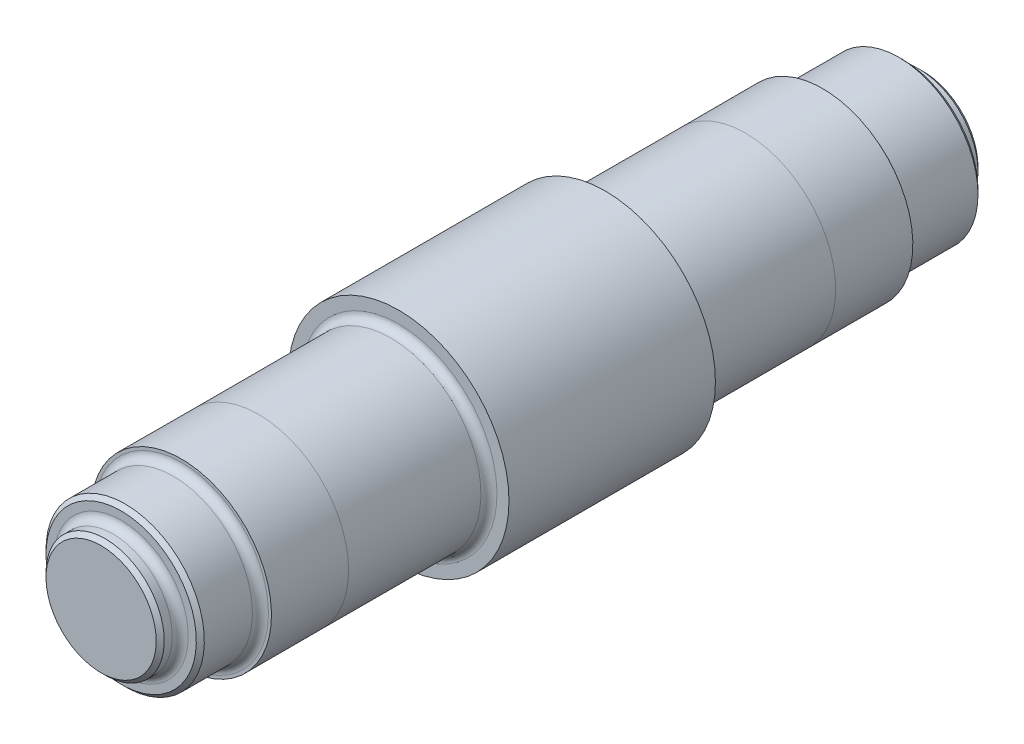
ISO-10303-21;
HEADER;
FILE_DESCRIPTION(('STEP AP214'),'2;1');
FILE_NAME('part.step','',(''),(''),'','','');
FILE_SCHEMA(('AUTOMOTIVE_DESIGN { 1 0 10303 214 1 1 1 1 }'));
ENDSEC;
DATA;
#1=APPLICATION_CONTEXT('core data for automotive mechanical design processes');
#2=APPLICATION_PROTOCOL_DEFINITION('international standard','automotive_design',2000,#1);
#3=PRODUCT_CONTEXT('',#1,'mechanical');
#4=PRODUCT('Part','Part','',(#3));
#5=PRODUCT_RELATED_PRODUCT_CATEGORY('part','',(#4));
#6=PRODUCT_DEFINITION_FORMATION('','',#4);
#7=PRODUCT_DEFINITION_CONTEXT('part definition',#1,'design');
#8=PRODUCT_DEFINITION('design','',#6,#7);
#9=PRODUCT_DEFINITION_SHAPE('','',#8);
#10=(LENGTH_UNIT() NAMED_UNIT(*) SI_UNIT(.MILLI.,.METRE.));
#11=(NAMED_UNIT(*) PLANE_ANGLE_UNIT() SI_UNIT($,.RADIAN.));
#12=(NAMED_UNIT(*) SI_UNIT($,.STERADIAN.) SOLID_ANGLE_UNIT());
#13=UNCERTAINTY_MEASURE_WITH_UNIT(LENGTH_MEASURE(1.E-05),#10,'distance_accuracy_value','');
#14=(GEOMETRIC_REPRESENTATION_CONTEXT(3) GLOBAL_UNCERTAINTY_ASSIGNED_CONTEXT((#13)) GLOBAL_UNIT_ASSIGNED_CONTEXT((#10,
#11,#12)) REPRESENTATION_CONTEXT('',''));
#15=CARTESIAN_POINT('',(0.,0.,0.));
#16=DIRECTION('',(0.,0.,1.));
#17=DIRECTION('',(1.,0.,0.));
#18=AXIS2_PLACEMENT_3D('',#15,#16,#17);
#19=CARTESIAN_POINT('',(0.,0.,20.));
#20=DIRECTION('',(0.,0.,1.));
#21=DIRECTION('',(0.,-1.,0.));
#22=AXIS2_PLACEMENT_3D('',#19,#20,#21);
#23=CYLINDRICAL_SURFACE('',#22,4.5);
#24=CARTESIAN_POINT('',(0.,0.,5.55));
#25=DIRECTION('',(0.,0.,-1.));
#26=DIRECTION('',(0.,1.,0.));
#27=AXIS2_PLACEMENT_3D('',#24,#25,#26);
#28=CIRCLE('',#27,4.5);
#29=CARTESIAN_POINT('',(0.,4.5,5.55));
#30=VERTEX_POINT('',#29);
#31=EDGE_CURVE('E134',#30,#30,#28,.F.);
#32=ORIENTED_EDGE('',*,*,#31,.T.);
#33=EDGE_LOOP('',(#32));
#34=FACE_BOUND('',#33,.T.);
#35=CARTESIAN_POINT('',(0.,0.,12.15));
#36=DIRECTION('',(0.,0.,1.));
#37=DIRECTION('',(1.,0.,0.));
#38=AXIS2_PLACEMENT_3D('',#35,#36,#37);
#39=CIRCLE('',#38,4.5);
#40=CARTESIAN_POINT('',(0.,4.5,12.15));
#41=VERTEX_POINT('',#40);
#42=CARTESIAN_POINT('',(0.,-4.5,12.15));
#43=VERTEX_POINT('',#42);
#44=EDGE_CURVE('E12',#41,#43,#39,.T.);
#45=ORIENTED_EDGE('',*,*,#44,.F.);
#46=EDGE_CURVE('E45',#43,#41,#39,.T.);
#47=ORIENTED_EDGE('',*,*,#46,.F.);
#48=EDGE_LOOP('',(#45,#47));
#49=FACE_BOUND('',#48,.T.);
#50=ADVANCED_FACE('F40',(#34,#49),#23,.T.);
#51=CARTESIAN_POINT('',(0.,0.,20.));
#52=DIRECTION('',(0.,0.,1.));
#53=DIRECTION('',(0.,-1.,0.));
#54=AXIS2_PLACEMENT_3D('',#51,#52,#53);
#55=CYLINDRICAL_SURFACE('',#54,4.5);
#56=CARTESIAN_POINT('',(0.,0.,-5.55));
#57=DIRECTION('',(0.,0.,1.));
#58=DIRECTION('',(0.,-1.,0.));
#59=AXIS2_PLACEMENT_3D('',#56,#57,#58);
#60=CIRCLE('',#59,4.5);
#61=CARTESIAN_POINT('',(0.,-4.5,-5.55));
#62=VERTEX_POINT('',#61);
#63=EDGE_CURVE('E125',#62,#62,#60,.F.);
#64=ORIENTED_EDGE('',*,*,#63,.T.);
#65=EDGE_LOOP('',(#64));
#66=FACE_BOUND('',#65,.T.);
#67=CARTESIAN_POINT('',(0.,0.,-12.15));
#68=DIRECTION('',(0.,0.,-1.));
#69=DIRECTION('',(-1.,0.,0.));
#70=AXIS2_PLACEMENT_3D('',#67,#68,#69);
#71=CIRCLE('',#70,4.5);
#72=CARTESIAN_POINT('',(0.,4.5,-12.15));
#73=VERTEX_POINT('',#72);
#74=CARTESIAN_POINT('',(0.,-4.5,-12.15));
#75=VERTEX_POINT('',#74);
#76=EDGE_CURVE('E65',#73,#75,#71,.T.);
#77=ORIENTED_EDGE('',*,*,#76,.F.);
#78=EDGE_CURVE('E69',#75,#73,#71,.T.);
#79=ORIENTED_EDGE('',*,*,#78,.F.);
#80=EDGE_LOOP('',(#77,#79));
#81=FACE_BOUND('',#80,.T.);
#82=ADVANCED_FACE('F72',(#66,#81),#55,.T.);
#83=CARTESIAN_POINT('',(0.,0.,20.));
#84=DIRECTION('',(0.,0.,1.));
#85=DIRECTION('',(0.,-1.,0.));
#86=AXIS2_PLACEMENT_3D('',#83,#84,#85);
#87=CYLINDRICAL_SURFACE('',#86,3.95);
#88=CARTESIAN_POINT('',(0.,0.,-19.8));
#89=DIRECTION('',(0.,0.,-1.));
#90=DIRECTION('',(0.,1.,0.));
#91=AXIS2_PLACEMENT_3D('',#88,#89,#90);
#92=CIRCLE('',#91,3.95);
#93=CARTESIAN_POINT('',(0.,3.95,-19.8));
#94=VERTEX_POINT('',#93);
#95=EDGE_CURVE('E83',#94,#94,#92,.F.);
#96=ORIENTED_EDGE('',*,*,#95,.T.);
#97=EDGE_LOOP('',(#96));
#98=FACE_BOUND('',#97,.T.);
#99=CARTESIAN_POINT('',(0.,0.,-16.4));
#100=DIRECTION('',(0.,0.,1.));
#101=DIRECTION('',(0.,-1.,0.));
#102=AXIS2_PLACEMENT_3D('',#99,#100,#101);
#103=CIRCLE('',#102,3.95);
#104=CARTESIAN_POINT('',(0.,-3.95000000000001,-16.4));
#105=VERTEX_POINT('',#104);
#106=EDGE_CURVE('E113',#105,#105,#103,.F.);
#107=ORIENTED_EDGE('',*,*,#106,.T.);
#108=EDGE_LOOP('',(#107));
#109=FACE_BOUND('',#108,.T.);
#110=ADVANCED_FACE('F175',(#98,#109),#87,.T.);
#111=ORIENTED_EDGE('',*,*,#78,.T.);
#112=ORIENTED_EDGE('',*,*,#76,.T.);
#113=EDGE_LOOP('',(#111,#112));
#114=FACE_BOUND('',#113,.T.);
#115=CARTESIAN_POINT('',(0.,0.,-16.));
#116=DIRECTION('',(0.,0.,1.));
#117=DIRECTION('',(0.,-1.,0.));
#118=AXIS2_PLACEMENT_3D('',#115,#116,#117);
#119=CIRCLE('',#118,4.5);
#120=CARTESIAN_POINT('',(0.,-4.5,-16.));
#121=VERTEX_POINT('',#120);
#122=EDGE_CURVE('E137',#121,#121,#119,.T.);
#123=ORIENTED_EDGE('',*,*,#122,.T.);
#124=EDGE_LOOP('',(#123));
#125=FACE_BOUND('',#124,.T.);
#126=ADVANCED_FACE('F67',(#114,#125),#55,.T.);
#127=CARTESIAN_POINT('',(0.,4.5,-16.));
#128=DIRECTION('',(0.,0.,1.));
#129=DIRECTION('',(0.,-1.,0.));
#130=AXIS2_PLACEMENT_3D('',#127,#128,#129);
#131=PLANE('',#130);
#132=CARTESIAN_POINT('',(0.,0.,-16.));
#133=DIRECTION('',(0.,0.,1.));
#134=DIRECTION('',(0.,-1.,0.));
#135=AXIS2_PLACEMENT_3D('',#132,#133,#134);
#136=CIRCLE('',#135,4.35);
#137=CARTESIAN_POINT('',(0.,-4.35000000000001,-16.));
#138=VERTEX_POINT('',#137);
#139=EDGE_CURVE('E116',#138,#138,#136,.T.);
#140=ORIENTED_EDGE('',*,*,#139,.T.);
#141=EDGE_LOOP('',(#140));
#142=FACE_BOUND('',#141,.T.);
#143=ORIENTED_EDGE('',*,*,#122,.F.);
#144=EDGE_LOOP('',(#143));
#145=FACE_BOUND('',#144,.T.);
#146=ADVANCED_FACE('F202',(#142,#145),#131,.F.);
#147=CARTESIAN_POINT('',(0.,0.,20.));
#148=DIRECTION('',(0.,0.,1.));
#149=DIRECTION('',(0.,-1.,0.));
#150=AXIS2_PLACEMENT_3D('',#147,#148,#149);
#151=CYLINDRICAL_SURFACE('',#150,3.94999999999999);
#152=CARTESIAN_POINT('',(0.,0.,18.8));
#153=DIRECTION('',(0.,0.,-1.));
#154=DIRECTION('',(0.,1.,0.));
#155=AXIS2_PLACEMENT_3D('',#152,#153,#154);
#156=CIRCLE('',#155,3.94999999999999);
#157=CARTESIAN_POINT('',(0.,3.94999999999999,18.8));
#158=VERTEX_POINT('',#157);
#159=EDGE_CURVE('E92',#158,#158,#156,.T.);
#160=ORIENTED_EDGE('',*,*,#159,.T.);
#161=EDGE_LOOP('',(#160));
#162=FACE_BOUND('',#161,.T.);
#163=CARTESIAN_POINT('',(0.,0.,16.4));
#164=DIRECTION('',(0.,0.,-1.));
#165=DIRECTION('',(0.,1.,0.));
#166=AXIS2_PLACEMENT_3D('',#163,#164,#165);
#167=CIRCLE('',#166,3.94999999999999);
#168=CARTESIAN_POINT('',(0.,3.94999999999999,16.4));
#169=VERTEX_POINT('',#168);
#170=EDGE_CURVE('E122',#169,#169,#167,.F.);
#171=ORIENTED_EDGE('',*,*,#170,.T.);
#172=EDGE_LOOP('',(#171));
#173=FACE_BOUND('',#172,.T.);
#174=ADVANCED_FACE('F187',(#162,#173),#151,.T.);
#175=CARTESIAN_POINT('',(0.,4.5,16.));
#176=DIRECTION('',(0.,0.,-1.));
#177=DIRECTION('',(0.,1.,0.));
#178=AXIS2_PLACEMENT_3D('',#175,#176,#177);
#179=PLANE('',#178);
#180=CARTESIAN_POINT('',(0.,0.,16.));
#181=DIRECTION('',(0.,0.,-1.));
#182=DIRECTION('',(0.,1.,0.));
#183=AXIS2_PLACEMENT_3D('',#180,#181,#182);
#184=CIRCLE('',#183,4.34999999999999);
#185=CARTESIAN_POINT('',(0.,4.34999999999999,16.));
#186=VERTEX_POINT('',#185);
#187=EDGE_CURVE('E119',#186,#186,#184,.T.);
#188=ORIENTED_EDGE('',*,*,#187,.T.);
#189=EDGE_LOOP('',(#188));
#190=FACE_BOUND('',#189,.T.);
#191=CARTESIAN_POINT('',(0.,0.,16.));
#192=DIRECTION('',(0.,0.,1.));
#193=DIRECTION('',(0.,-1.,0.));
#194=AXIS2_PLACEMENT_3D('',#191,#192,#193);
#195=CIRCLE('',#194,4.5);
#196=CARTESIAN_POINT('',(0.,-4.5,16.));
#197=VERTEX_POINT('',#196);
#198=EDGE_CURVE('E140',#197,#197,#195,.T.);
#199=ORIENTED_EDGE('',*,*,#198,.T.);
#200=EDGE_LOOP('',(#199));
#201=FACE_BOUND('',#200,.T.);
#202=ADVANCED_FACE('F181',(#190,#201),#179,.F.);
#203=ORIENTED_EDGE('',*,*,#46,.T.);
#204=ORIENTED_EDGE('',*,*,#44,.T.);
#205=EDGE_LOOP('',(#203,#204));
#206=FACE_BOUND('',#205,.T.);
#207=ORIENTED_EDGE('',*,*,#198,.F.);
#208=EDGE_LOOP('',(#207));
#209=FACE_BOUND('',#208,.T.);
#210=ADVANCED_FACE('F171',(#206,#209),#23,.T.);
#211=CARTESIAN_POINT('',(0.,5.5,5.15));
#212=DIRECTION('',(0.,0.,-1.));
#213=DIRECTION('',(0.,1.,0.));
#214=AXIS2_PLACEMENT_3D('',#211,#212,#213);
#215=PLANE('',#214);
#216=CARTESIAN_POINT('',(0.,0.,5.15));
#217=DIRECTION('',(0.,0.,-1.));
#218=DIRECTION('',(0.,1.,0.));
#219=AXIS2_PLACEMENT_3D('',#216,#217,#218);
#220=CIRCLE('',#219,4.9);
#221=CARTESIAN_POINT('',(0.,4.9,5.15));
#222=VERTEX_POINT('',#221);
#223=EDGE_CURVE('E131',#222,#222,#220,.T.);
#224=ORIENTED_EDGE('',*,*,#223,.T.);
#225=EDGE_LOOP('',(#224));
#226=FACE_BOUND('',#225,.T.);
#227=CARTESIAN_POINT('',(0.,0.,5.15));
#228=DIRECTION('',(0.,0.,1.));
#229=DIRECTION('',(0.,-1.,0.));
#230=AXIS2_PLACEMENT_3D('',#227,#228,#229);
#231=CIRCLE('',#230,5.5);
#232=CARTESIAN_POINT('',(0.,-5.5,5.15));
#233=VERTEX_POINT('',#232);
#234=EDGE_CURVE('E143',#233,#233,#231,.T.);
#235=ORIENTED_EDGE('',*,*,#234,.T.);
#236=EDGE_LOOP('',(#235));
#237=FACE_BOUND('',#236,.T.);
#238=ADVANCED_FACE('F164',(#226,#237),#215,.F.);
#239=CARTESIAN_POINT('',(0.,0.,20.));
#240=DIRECTION('',(0.,0.,1.));
#241=DIRECTION('',(0.,-1.,0.));
#242=AXIS2_PLACEMENT_3D('',#239,#240,#241);
#243=CYLINDRICAL_SURFACE('',#242,5.5);
#244=ORIENTED_EDGE('',*,*,#234,.F.);
#245=EDGE_LOOP('',(#244));
#246=FACE_BOUND('',#245,.T.);
#247=CARTESIAN_POINT('',(0.,0.,-5.15));
#248=DIRECTION('',(0.,0.,1.));
#249=DIRECTION('',(0.,-1.,0.));
#250=AXIS2_PLACEMENT_3D('',#247,#248,#249);
#251=CIRCLE('',#250,5.5);
#252=CARTESIAN_POINT('',(0.,-5.50000000000001,-5.15));
#253=VERTEX_POINT('',#252);
#254=EDGE_CURVE('E146',#253,#253,#251,.T.);
#255=ORIENTED_EDGE('',*,*,#254,.T.);
#256=EDGE_LOOP('',(#255));
#257=FACE_BOUND('',#256,.T.);
#258=ADVANCED_FACE('F150',(#246,#257),#243,.T.);
#259=CARTESIAN_POINT('',(0.,5.5,-5.15));
#260=DIRECTION('',(0.,0.,1.));
#261=DIRECTION('',(0.,-1.,0.));
#262=AXIS2_PLACEMENT_3D('',#259,#260,#261);
#263=PLANE('',#262);
#264=CARTESIAN_POINT('',(0.,0.,-5.15));
#265=DIRECTION('',(0.,0.,1.));
#266=DIRECTION('',(0.,-1.,0.));
#267=AXIS2_PLACEMENT_3D('',#264,#265,#266);
#268=CIRCLE('',#267,4.9);
#269=CARTESIAN_POINT('',(0.,-4.9,-5.15));
#270=VERTEX_POINT('',#269);
#271=EDGE_CURVE('E128',#270,#270,#268,.T.);
#272=ORIENTED_EDGE('',*,*,#271,.T.);
#273=EDGE_LOOP('',(#272));
#274=FACE_BOUND('',#273,.T.);
#275=ORIENTED_EDGE('',*,*,#254,.F.);
#276=EDGE_LOOP('',(#275));
#277=FACE_BOUND('',#276,.T.);
#278=ADVANCED_FACE('F152',(#274,#277),#263,.F.);
#279=CARTESIAN_POINT('',(0.,0.,5.55));
#280=DIRECTION('',(0.,0.,-1.));
#281=DIRECTION('',(0.,1.,0.));
#282=AXIS2_PLACEMENT_3D('',#279,#280,#281);
#283=TOROIDAL_SURFACE('',#282,4.9,0.4);
#284=ORIENTED_EDGE('',*,*,#223,.F.);
#285=EDGE_LOOP('',(#284));
#286=FACE_BOUND('',#285,.T.);
#287=ORIENTED_EDGE('',*,*,#31,.F.);
#288=EDGE_LOOP('',(#287));
#289=FACE_BOUND('',#288,.T.);
#290=ADVANCED_FACE('F154',(#286,#289),#283,.F.);
#291=CARTESIAN_POINT('',(0.,0.,-5.55));
#292=DIRECTION('',(0.,0.,1.));
#293=DIRECTION('',(0.,-1.,0.));
#294=AXIS2_PLACEMENT_3D('',#291,#292,#293);
#295=TOROIDAL_SURFACE('',#294,4.9,0.4);
#296=ORIENTED_EDGE('',*,*,#63,.F.);
#297=EDGE_LOOP('',(#296));
#298=FACE_BOUND('',#297,.T.);
#299=ORIENTED_EDGE('',*,*,#271,.F.);
#300=EDGE_LOOP('',(#299));
#301=FACE_BOUND('',#300,.T.);
#302=ADVANCED_FACE('F161',(#298,#301),#295,.F.);
#303=CARTESIAN_POINT('',(0.,0.,16.4));
#304=DIRECTION('',(0.,0.,-1.));
#305=DIRECTION('',(0.,1.,0.));
#306=AXIS2_PLACEMENT_3D('',#303,#304,#305);
#307=TOROIDAL_SURFACE('',#306,4.34999999999999,0.4);
#308=ORIENTED_EDGE('',*,*,#187,.F.);
#309=EDGE_LOOP('',(#308));
#310=FACE_BOUND('',#309,.T.);
#311=ORIENTED_EDGE('',*,*,#170,.F.);
#312=EDGE_LOOP('',(#311));
#313=FACE_BOUND('',#312,.T.);
#314=ADVANCED_FACE('F227',(#310,#313),#307,.F.);
#315=CARTESIAN_POINT('',(0.,0.,-16.4));
#316=DIRECTION('',(0.,0.,1.));
#317=DIRECTION('',(0.,-1.,0.));
#318=AXIS2_PLACEMENT_3D('',#315,#316,#317);
#319=TOROIDAL_SURFACE('',#318,4.35,0.4);
#320=ORIENTED_EDGE('',*,*,#106,.F.);
#321=EDGE_LOOP('',(#320));
#322=FACE_BOUND('',#321,.T.);
#323=ORIENTED_EDGE('',*,*,#139,.F.);
#324=EDGE_LOOP('',(#323));
#325=FACE_BOUND('',#324,.T.);
#326=ADVANCED_FACE('F231',(#322,#325),#319,.F.);
#327=CARTESIAN_POINT('',(0.,0.,19.));
#328=DIRECTION('',(0.,0.,-1.));
#329=DIRECTION('',(0.,1.,0.));
#330=AXIS2_PLACEMENT_3D('',#327,#328,#329);
#331=PLANE('',#330);
#332=CARTESIAN_POINT('',(0.,0.,19.));
#333=DIRECTION('',(0.,0.,-1.));
#334=DIRECTION('',(0.,1.,0.));
#335=AXIS2_PLACEMENT_3D('',#332,#333,#334);
#336=CIRCLE('',#335,3.74999999999999);
#337=CARTESIAN_POINT('',(0.,3.74999999999999,19.));
#338=VERTEX_POINT('',#337);
#339=EDGE_CURVE('E89',#338,#338,#336,.F.);
#340=ORIENTED_EDGE('',*,*,#339,.T.);
#341=EDGE_LOOP('',(#340));
#342=FACE_BOUND('',#341,.T.);
#343=CARTESIAN_POINT('',(0.,0.,19.));
#344=DIRECTION('',(0.,0.,-1.));
#345=DIRECTION('',(0.,1.,0.));
#346=AXIS2_PLACEMENT_3D('',#343,#344,#345);
#347=CIRCLE('',#346,3.35);
#348=CARTESIAN_POINT('',(0.,3.35,19.));
#349=VERTEX_POINT('',#348);
#350=EDGE_CURVE('E104',#349,#349,#347,.T.);
#351=ORIENTED_EDGE('',*,*,#350,.T.);
#352=EDGE_LOOP('',(#351));
#353=FACE_BOUND('',#352,.T.);
#354=ADVANCED_FACE('F235',(#342,#353),#331,.F.);
#355=CARTESIAN_POINT('',(0.,0.,19.));
#356=DIRECTION('',(0.,0.,1.));
#357=DIRECTION('',(1.,0.,0.));
#358=AXIS2_PLACEMENT_3D('',#355,#356,#357);
#359=CYLINDRICAL_SURFACE('',#358,2.95);
#360=CARTESIAN_POINT('',(0.,0.,19.8));
#361=DIRECTION('',(0.,0.,-1.));
#362=DIRECTION('',(-1.,0.,0.));
#363=AXIS2_PLACEMENT_3D('',#360,#361,#362);
#364=CIRCLE('',#363,2.95);
#365=CARTESIAN_POINT('',(-2.95,0.,19.8));
#366=VERTEX_POINT('',#365);
#367=EDGE_CURVE('E98',#366,#366,#364,.T.);
#368=ORIENTED_EDGE('',*,*,#367,.T.);
#369=EDGE_LOOP('',(#368));
#370=FACE_BOUND('',#369,.T.);
#371=CARTESIAN_POINT('',(0.,0.,19.4));
#372=DIRECTION('',(0.,0.,-1.));
#373=DIRECTION('',(0.,1.,0.));
#374=AXIS2_PLACEMENT_3D('',#371,#372,#373);
#375=CIRCLE('',#374,2.95);
#376=CARTESIAN_POINT('',(0.,2.95,19.4));
#377=VERTEX_POINT('',#376);
#378=EDGE_CURVE('E101',#377,#377,#375,.F.);
#379=ORIENTED_EDGE('',*,*,#378,.T.);
#380=EDGE_LOOP('',(#379));
#381=FACE_BOUND('',#380,.T.);
#382=ADVANCED_FACE('F210',(#370,#381),#359,.T.);
#383=CARTESIAN_POINT('',(0.,3.94999999999999,20.));
#384=DIRECTION('',(0.,0.,-1.));
#385=DIRECTION('',(0.,1.,0.));
#386=AXIS2_PLACEMENT_3D('',#383,#384,#385);
#387=PLANE('',#386);
#388=CARTESIAN_POINT('',(0.,0.,20.));
#389=DIRECTION('',(0.,0.,-1.));
#390=DIRECTION('',(0.,1.,0.));
#391=AXIS2_PLACEMENT_3D('',#388,#389,#390);
#392=CIRCLE('',#391,2.75);
#393=CARTESIAN_POINT('',(0.,2.75,20.));
#394=VERTEX_POINT('',#393);
#395=EDGE_CURVE('E95',#394,#394,#392,.F.);
#396=ORIENTED_EDGE('',*,*,#395,.T.);
#397=EDGE_LOOP('',(#396));
#398=FACE_BOUND('',#397,.T.);
#399=ADVANCED_FACE('F206',(#398),#387,.F.);
#400=CARTESIAN_POINT('',(0.,0.,-20.));
#401=DIRECTION('',(0.,0.,-1.));
#402=DIRECTION('',(0.,1.,0.));
#403=AXIS2_PLACEMENT_3D('',#400,#401,#402);
#404=PLANE('',#403);
#405=CARTESIAN_POINT('',(0.,0.,-20.));
#406=DIRECTION('',(0.,0.,-1.));
#407=DIRECTION('',(0.,1.,0.));
#408=AXIS2_PLACEMENT_3D('',#405,#406,#407);
#409=CIRCLE('',#408,3.75000000000002);
#410=CARTESIAN_POINT('',(0.,3.75000000000001,-20.));
#411=VERTEX_POINT('',#410);
#412=EDGE_CURVE('E86',#411,#411,#409,.T.);
#413=ORIENTED_EDGE('',*,*,#412,.T.);
#414=EDGE_LOOP('',(#413));
#415=FACE_BOUND('',#414,.T.);
#416=CARTESIAN_POINT('',(0.,0.,-20.));
#417=DIRECTION('',(0.,0.,-1.));
#418=DIRECTION('',(0.,1.,0.));
#419=AXIS2_PLACEMENT_3D('',#416,#417,#418);
#420=CIRCLE('',#419,3.35);
#421=CARTESIAN_POINT('',(0.,3.35,-20.));
#422=VERTEX_POINT('',#421);
#423=EDGE_CURVE('E110',#422,#422,#420,.F.);
#424=ORIENTED_EDGE('',*,*,#423,.T.);
#425=EDGE_LOOP('',(#424));
#426=FACE_BOUND('',#425,.T.);
#427=ADVANCED_FACE('F209',(#415,#426),#404,.T.);
#428=CARTESIAN_POINT('',(0.,0.,-20.));
#429=DIRECTION('',(0.,0.,-1.));
#430=DIRECTION('',(-1.,0.,0.));
#431=AXIS2_PLACEMENT_3D('',#428,#429,#430);
#432=CYLINDRICAL_SURFACE('',#431,2.95);
#433=CARTESIAN_POINT('',(0.,0.,-20.8));
#434=DIRECTION('',(0.,0.,1.));
#435=DIRECTION('',(1.,0.,0.));
#436=AXIS2_PLACEMENT_3D('',#433,#434,#435);
#437=CIRCLE('',#436,2.95);
#438=CARTESIAN_POINT('',(2.95,0.,-20.8));
#439=VERTEX_POINT('',#438);
#440=EDGE_CURVE('E78',#439,#439,#437,.T.);
#441=ORIENTED_EDGE('',*,*,#440,.T.);
#442=EDGE_LOOP('',(#441));
#443=FACE_BOUND('',#442,.T.);
#444=CARTESIAN_POINT('',(0.,0.,-20.4));
#445=DIRECTION('',(0.,0.,-1.));
#446=DIRECTION('',(0.,1.,0.));
#447=AXIS2_PLACEMENT_3D('',#444,#445,#446);
#448=CIRCLE('',#447,2.95);
#449=CARTESIAN_POINT('',(0.,2.95,-20.4));
#450=VERTEX_POINT('',#449);
#451=EDGE_CURVE('E107',#450,#450,#448,.T.);
#452=ORIENTED_EDGE('',*,*,#451,.T.);
#453=EDGE_LOOP('',(#452));
#454=FACE_BOUND('',#453,.T.);
#455=ADVANCED_FACE('F216',(#443,#454),#432,.T.);
#456=CARTESIAN_POINT('',(0.,0.,-21.));
#457=DIRECTION('',(0.,0.,1.));
#458=DIRECTION('',(0.,-1.,0.));
#459=AXIS2_PLACEMENT_3D('',#456,#457,#458);
#460=PLANE('',#459);
#461=CARTESIAN_POINT('',(0.,0.,-21.));
#462=DIRECTION('',(0.,0.,1.));
#463=DIRECTION('',(0.,-1.,0.));
#464=AXIS2_PLACEMENT_3D('',#461,#462,#463);
#465=CIRCLE('',#464,2.75);
#466=CARTESIAN_POINT('',(0.,-2.75,-21.));
#467=VERTEX_POINT('',#466);
#468=EDGE_CURVE('E74',#467,#467,#465,.F.);
#469=ORIENTED_EDGE('',*,*,#468,.T.);
#470=EDGE_LOOP('',(#469));
#471=FACE_BOUND('',#470,.T.);
#472=ADVANCED_FACE('F212',(#471),#460,.F.);
#473=CARTESIAN_POINT('',(0.,0.,-20.4));
#474=DIRECTION('',(0.,0.,-1.));
#475=DIRECTION('',(0.,1.,0.));
#476=AXIS2_PLACEMENT_3D('',#473,#474,#475);
#477=TOROIDAL_SURFACE('',#476,3.35,0.4);
#478=ORIENTED_EDGE('',*,*,#451,.F.);
#479=EDGE_LOOP('',(#478));
#480=FACE_BOUND('',#479,.T.);
#481=ORIENTED_EDGE('',*,*,#423,.F.);
#482=EDGE_LOOP('',(#481));
#483=FACE_BOUND('',#482,.T.);
#484=ADVANCED_FACE('F215',(#480,#483),#477,.F.);
#485=CARTESIAN_POINT('',(0.,0.,19.4));
#486=DIRECTION('',(0.,0.,-1.));
#487=DIRECTION('',(0.,1.,0.));
#488=AXIS2_PLACEMENT_3D('',#485,#486,#487);
#489=TOROIDAL_SURFACE('',#488,3.35,0.4);
#490=ORIENTED_EDGE('',*,*,#378,.F.);
#491=EDGE_LOOP('',(#490));
#492=FACE_BOUND('',#491,.T.);
#493=ORIENTED_EDGE('',*,*,#350,.F.);
#494=EDGE_LOOP('',(#493));
#495=FACE_BOUND('',#494,.T.);
#496=ADVANCED_FACE('F239',(#492,#495),#489,.F.);
#497=CARTESIAN_POINT('',(0.,0.,19.8));
#498=DIRECTION('',(0.,0.,-1.));
#499=DIRECTION('',(-1.,0.,0.));
#500=AXIS2_PLACEMENT_3D('',#497,#498,#499);
#501=CONICAL_SURFACE('',#500,2.95,0.785398163397447);
#502=ORIENTED_EDGE('',*,*,#395,.F.);
#503=EDGE_LOOP('',(#502));
#504=FACE_BOUND('',#503,.T.);
#505=ORIENTED_EDGE('',*,*,#367,.F.);
#506=EDGE_LOOP('',(#505));
#507=FACE_BOUND('',#506,.T.);
#508=ADVANCED_FACE('F243',(#504,#507),#501,.T.);
#509=CARTESIAN_POINT('',(0.,0.,18.8));
#510=DIRECTION('',(0.,0.,-1.));
#511=DIRECTION('',(0.,1.,0.));
#512=AXIS2_PLACEMENT_3D('',#509,#510,#511);
#513=CONICAL_SURFACE('',#512,3.94999999999999,0.785398163397455);
#514=ORIENTED_EDGE('',*,*,#339,.F.);
#515=EDGE_LOOP('',(#514));
#516=FACE_BOUND('',#515,.T.);
#517=ORIENTED_EDGE('',*,*,#159,.F.);
#518=EDGE_LOOP('',(#517));
#519=FACE_BOUND('',#518,.T.);
#520=ADVANCED_FACE('F251',(#516,#519),#513,.T.);
#521=CARTESIAN_POINT('',(0.,0.,-20.));
#522=DIRECTION('',(0.,0.,1.));
#523=DIRECTION('',(0.,-1.,0.));
#524=AXIS2_PLACEMENT_3D('',#521,#522,#523);
#525=CONICAL_SURFACE('',#524,3.75000000000002,0.785398163397448);
#526=ORIENTED_EDGE('',*,*,#95,.F.);
#527=EDGE_LOOP('',(#526));
#528=FACE_BOUND('',#527,.T.);
#529=ORIENTED_EDGE('',*,*,#412,.F.);
#530=EDGE_LOOP('',(#529));
#531=FACE_BOUND('',#530,.T.);
#532=ADVANCED_FACE('F257',(#528,#531),#525,.T.);
#533=CARTESIAN_POINT('',(0.,0.,-20.8));
#534=DIRECTION('',(0.,0.,1.));
#535=DIRECTION('',(1.,0.,0.));
#536=AXIS2_PLACEMENT_3D('',#533,#534,#535);
#537=CONICAL_SURFACE('',#536,2.95,0.785398163397451);
#538=ORIENTED_EDGE('',*,*,#468,.F.);
#539=EDGE_LOOP('',(#538));
#540=FACE_BOUND('',#539,.T.);
#541=ORIENTED_EDGE('',*,*,#440,.F.);
#542=EDGE_LOOP('',(#541));
#543=FACE_BOUND('',#542,.T.);
#544=ADVANCED_FACE('F43',(#540,#543),#537,.T.);
#545=CLOSED_SHELL('',(#50,#82,#110,#126,#146,#174,#202,#210,#238,#258,#278,#290,#302,#314,#326,
#354,#382,#399,#427,#455,#472,#484,#496,#508,#520,#532,#544));
#546=MANIFOLD_SOLID_BREP('B2',#545);
#547=ADVANCED_BREP_SHAPE_REPRESENTATION('',(#18,#546),#14);
#548=SHAPE_DEFINITION_REPRESENTATION(#9,#547);
ENDSEC;
END-ISO-10303-21;
